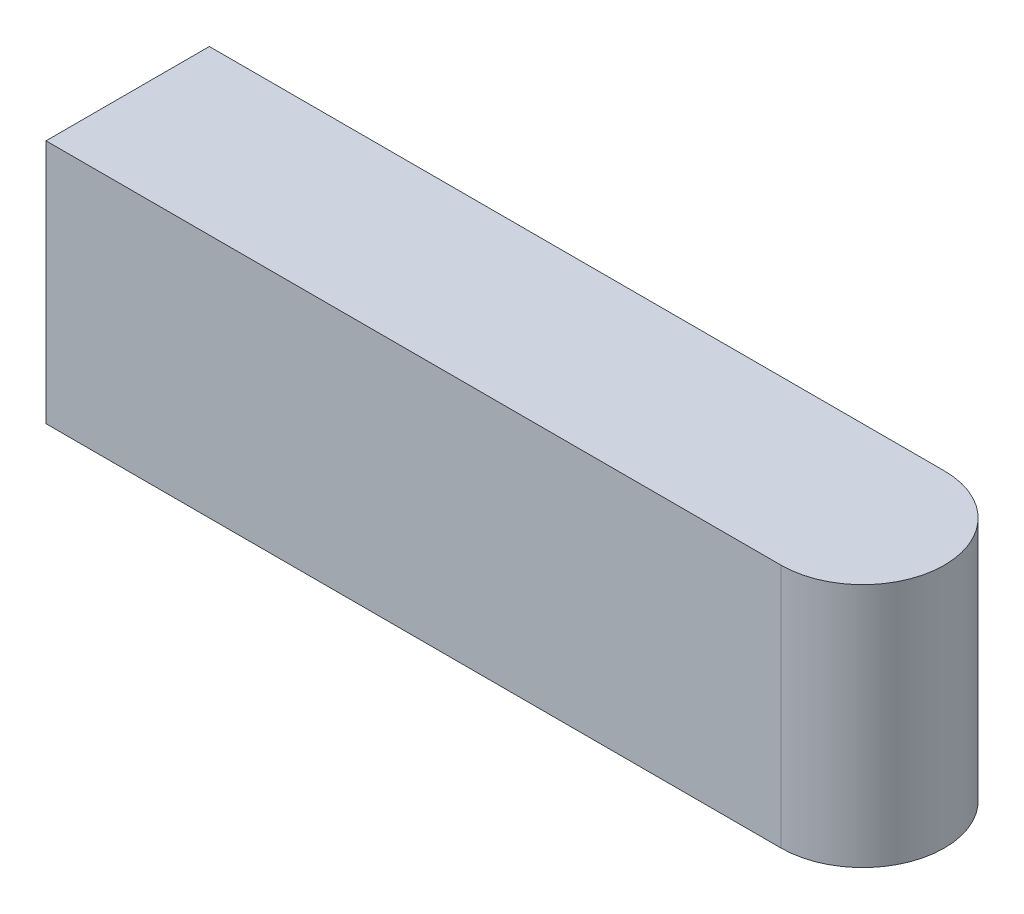
ISO-10303-21;
HEADER;
FILE_DESCRIPTION(('STEP AP214'),'2;1');
FILE_NAME('part.step','',(''),(''),'','','');
FILE_SCHEMA(('AUTOMOTIVE_DESIGN { 1 0 10303 214 1 1 1 1 }'));
ENDSEC;
DATA;
#1=APPLICATION_CONTEXT('core data for automotive mechanical design processes');
#2=APPLICATION_PROTOCOL_DEFINITION('international standard','automotive_design',2000,#1);
#3=PRODUCT_CONTEXT('',#1,'mechanical');
#4=PRODUCT('Part','Part','',(#3));
#5=PRODUCT_RELATED_PRODUCT_CATEGORY('part','',(#4));
#6=PRODUCT_DEFINITION_FORMATION('','',#4);
#7=PRODUCT_DEFINITION_CONTEXT('part definition',#1,'design');
#8=PRODUCT_DEFINITION('design','',#6,#7);
#9=PRODUCT_DEFINITION_SHAPE('','',#8);
#10=(LENGTH_UNIT() NAMED_UNIT(*) SI_UNIT(.MILLI.,.METRE.));
#11=(NAMED_UNIT(*) PLANE_ANGLE_UNIT() SI_UNIT($,.RADIAN.));
#12=(NAMED_UNIT(*) SI_UNIT($,.STERADIAN.) SOLID_ANGLE_UNIT());
#13=UNCERTAINTY_MEASURE_WITH_UNIT(LENGTH_MEASURE(1.E-05),#10,'distance_accuracy_value','');
#14=(GEOMETRIC_REPRESENTATION_CONTEXT(3) GLOBAL_UNCERTAINTY_ASSIGNED_CONTEXT((#13)) GLOBAL_UNIT_ASSIGNED_CONTEXT((#10,
#11,#12)) REPRESENTATION_CONTEXT('',''));
#15=CARTESIAN_POINT('',(0.,0.,0.));
#16=DIRECTION('',(0.,0.,1.));
#17=DIRECTION('',(1.,0.,0.));
#18=AXIS2_PLACEMENT_3D('',#15,#16,#17);
#19=CARTESIAN_POINT('',(7.99999999999999,0.,0.));
#20=DIRECTION('',(0.,-1.,0.));
#21=DIRECTION('',(0.,0.,-1.));
#22=AXIS2_PLACEMENT_3D('',#19,#20,#21);
#23=CYLINDRICAL_SURFACE('',#22,2.);
#24=DIRECTION('',(0.,-1.,0.));
#25=VECTOR('',#24,1.);
#26=CARTESIAN_POINT('',(7.99999999999999,6.,2.));
#27=LINE('',#26,#25);
#28=CARTESIAN_POINT('',(7.99999999999999,0.,2.));
#29=VERTEX_POINT('',#28);
#30=CARTESIAN_POINT('',(7.99999999999999,6.,2.));
#31=VERTEX_POINT('',#30);
#32=EDGE_CURVE('E96',#29,#31,#27,.F.);
#33=ORIENTED_EDGE('',*,*,#32,.F.);
#34=CARTESIAN_POINT('',(7.99999999999999,0.,0.));
#35=DIRECTION('',(0.,-1.,0.));
#36=DIRECTION('',(0.,0.,-1.));
#37=AXIS2_PLACEMENT_3D('',#34,#35,#36);
#38=CIRCLE('',#37,2.);
#39=CARTESIAN_POINT('',(7.99999999999999,0.,-2.));
#40=VERTEX_POINT('',#39);
#41=EDGE_CURVE('E50',#40,#29,#38,.T.);
#42=ORIENTED_EDGE('',*,*,#41,.F.);
#43=DIRECTION('',(0.,-1.,0.));
#44=VECTOR('',#43,1.);
#45=CARTESIAN_POINT('',(7.99999999999999,6.,-2.));
#46=LINE('',#45,#44);
#47=CARTESIAN_POINT('',(7.99999999999999,6.,-2.));
#48=VERTEX_POINT('',#47);
#49=EDGE_CURVE('E121',#48,#40,#46,.T.);
#50=ORIENTED_EDGE('',*,*,#49,.F.);
#51=CARTESIAN_POINT('',(7.99999999999999,6.,0.));
#52=DIRECTION('',(0.,-1.,0.));
#53=DIRECTION('',(0.,0.,-1.));
#54=AXIS2_PLACEMENT_3D('',#51,#52,#53);
#55=CIRCLE('',#54,2.);
#56=EDGE_CURVE('E11',#31,#48,#55,.F.);
#57=ORIENTED_EDGE('',*,*,#56,.F.);
#58=EDGE_LOOP('',(#33,#42,#50,#57));
#59=FACE_BOUND('',#58,.T.);
#60=ADVANCED_FACE('F41',(#59),#23,.T.);
#61=CARTESIAN_POINT('',(-10.,6.,-2.));
#62=DIRECTION('',(0.,0.,1.));
#63=DIRECTION('',(1.,0.,0.));
#64=AXIS2_PLACEMENT_3D('',#61,#62,#63);
#65=PLANE('',#64);
#66=DIRECTION('',(-1.,0.,0.));
#67=VECTOR('',#66,1.);
#68=CARTESIAN_POINT('',(-10.,6.,-2.));
#69=LINE('',#68,#67);
#70=CARTESIAN_POINT('',(-10.,6.,-2.));
#71=VERTEX_POINT('',#70);
#72=EDGE_CURVE('E78',#48,#71,#69,.T.);
#73=ORIENTED_EDGE('',*,*,#72,.F.);
#74=ORIENTED_EDGE('',*,*,#49,.T.);
#75=DIRECTION('',(-1.,0.,0.));
#76=VECTOR('',#75,1.);
#77=CARTESIAN_POINT('',(-10.,0.,-2.));
#78=LINE('',#77,#76);
#79=CARTESIAN_POINT('',(-10.,0.,-2.));
#80=VERTEX_POINT('',#79);
#81=EDGE_CURVE('E92',#40,#80,#78,.T.);
#82=ORIENTED_EDGE('',*,*,#81,.T.);
#83=DIRECTION('',(0.,-1.,0.));
#84=VECTOR('',#83,1.);
#85=CARTESIAN_POINT('',(-10.,6.,-2.));
#86=LINE('',#85,#84);
#87=EDGE_CURVE('E89',#71,#80,#86,.T.);
#88=ORIENTED_EDGE('',*,*,#87,.F.);
#89=EDGE_LOOP('',(#73,#74,#82,#88));
#90=FACE_BOUND('',#89,.T.);
#91=ADVANCED_FACE('F90',(#90),#65,.F.);
#92=CARTESIAN_POINT('',(-10.,6.,2.));
#93=DIRECTION('',(1.,0.,0.));
#94=DIRECTION('',(0.,0.,-1.));
#95=AXIS2_PLACEMENT_3D('',#92,#93,#94);
#96=PLANE('',#95);
#97=DIRECTION('',(0.,0.,1.));
#98=VECTOR('',#97,1.);
#99=CARTESIAN_POINT('',(-10.,0.,2.));
#100=LINE('',#99,#98);
#101=CARTESIAN_POINT('',(-10.,0.,2.));
#102=VERTEX_POINT('',#101);
#103=EDGE_CURVE('E110',#80,#102,#100,.T.);
#104=ORIENTED_EDGE('',*,*,#103,.T.);
#105=DIRECTION('',(0.,-1.,0.));
#106=VECTOR('',#105,1.);
#107=CARTESIAN_POINT('',(-10.,6.,2.));
#108=LINE('',#107,#106);
#109=CARTESIAN_POINT('',(-10.,6.,2.));
#110=VERTEX_POINT('',#109);
#111=EDGE_CURVE('E97',#110,#102,#108,.T.);
#112=ORIENTED_EDGE('',*,*,#111,.F.);
#113=DIRECTION('',(0.,0.,1.));
#114=VECTOR('',#113,1.);
#115=CARTESIAN_POINT('',(-10.,6.,2.));
#116=LINE('',#115,#114);
#117=EDGE_CURVE('E82',#71,#110,#116,.T.);
#118=ORIENTED_EDGE('',*,*,#117,.F.);
#119=ORIENTED_EDGE('',*,*,#87,.T.);
#120=EDGE_LOOP('',(#104,#112,#118,#119));
#121=FACE_BOUND('',#120,.T.);
#122=ADVANCED_FACE('F99',(#121),#96,.F.);
#123=CARTESIAN_POINT('',(-10.,6.,2.));
#124=DIRECTION('',(0.,0.,-1.));
#125=DIRECTION('',(-1.,0.,0.));
#126=AXIS2_PLACEMENT_3D('',#123,#124,#125);
#127=PLANE('',#126);
#128=DIRECTION('',(1.,0.,0.));
#129=VECTOR('',#128,1.);
#130=CARTESIAN_POINT('',(-10.,0.,2.));
#131=LINE('',#130,#129);
#132=EDGE_CURVE('E86',#102,#29,#131,.T.);
#133=ORIENTED_EDGE('',*,*,#132,.T.);
#134=ORIENTED_EDGE('',*,*,#32,.T.);
#135=DIRECTION('',(1.,0.,0.));
#136=VECTOR('',#135,1.);
#137=CARTESIAN_POINT('',(-10.,6.,2.));
#138=LINE('',#137,#136);
#139=EDGE_CURVE('E103',#110,#31,#138,.T.);
#140=ORIENTED_EDGE('',*,*,#139,.F.);
#141=ORIENTED_EDGE('',*,*,#111,.T.);
#142=EDGE_LOOP('',(#133,#134,#140,#141));
#143=FACE_BOUND('',#142,.T.);
#144=ADVANCED_FACE('F128',(#143),#127,.F.);
#145=CARTESIAN_POINT('',(0.,6.,0.));
#146=DIRECTION('',(0.,-1.,0.));
#147=DIRECTION('',(0.,0.,-1.));
#148=AXIS2_PLACEMENT_3D('',#145,#146,#147);
#149=PLANE('',#148);
#150=ORIENTED_EDGE('',*,*,#139,.T.);
#151=ORIENTED_EDGE('',*,*,#56,.T.);
#152=ORIENTED_EDGE('',*,*,#72,.T.);
#153=ORIENTED_EDGE('',*,*,#117,.T.);
#154=EDGE_LOOP('',(#150,#151,#152,#153));
#155=FACE_BOUND('',#154,.T.);
#156=ADVANCED_FACE('F80',(#155),#149,.F.);
#157=CARTESIAN_POINT('',(0.,0.,0.));
#158=DIRECTION('',(0.,-1.,0.));
#159=DIRECTION('',(0.,0.,-1.));
#160=AXIS2_PLACEMENT_3D('',#157,#158,#159);
#161=PLANE('',#160);
#162=ORIENTED_EDGE('',*,*,#81,.F.);
#163=ORIENTED_EDGE('',*,*,#41,.T.);
#164=ORIENTED_EDGE('',*,*,#132,.F.);
#165=ORIENTED_EDGE('',*,*,#103,.F.);
#166=EDGE_LOOP('',(#162,#163,#164,#165));
#167=FACE_BOUND('',#166,.T.);
#168=ADVANCED_FACE('F126',(#167),#161,.T.);
#169=CLOSED_SHELL('',(#60,#91,#122,#144,#156,#168));
#170=MANIFOLD_SOLID_BREP('B2',#169);
#171=ADVANCED_BREP_SHAPE_REPRESENTATION('',(#18,#170),#14);
#172=SHAPE_DEFINITION_REPRESENTATION(#9,#171);
ENDSEC;
END-ISO-10303-21;
